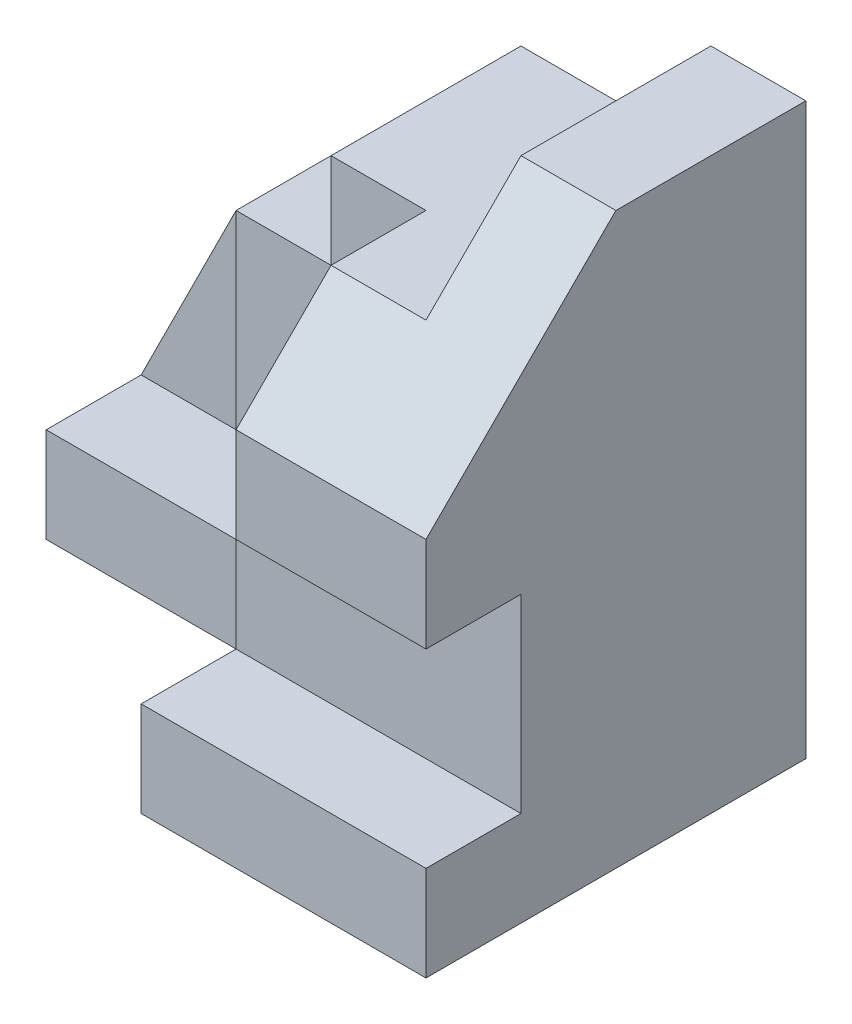
ISO-10303-21;
HEADER;
FILE_DESCRIPTION(('STEP AP214'),'2;1');
FILE_NAME('part.step','',(''),(''),'','','');
FILE_SCHEMA(('AUTOMOTIVE_DESIGN { 1 0 10303 214 1 1 1 1 }'));
ENDSEC;
DATA;
#1=APPLICATION_CONTEXT('core data for automotive mechanical design processes');
#2=APPLICATION_PROTOCOL_DEFINITION('international standard','automotive_design',2000,#1);
#3=PRODUCT_CONTEXT('',#1,'mechanical');
#4=PRODUCT('Part','Part','',(#3));
#5=PRODUCT_RELATED_PRODUCT_CATEGORY('part','',(#4));
#6=PRODUCT_DEFINITION_FORMATION('','',#4);
#7=PRODUCT_DEFINITION_CONTEXT('part definition',#1,'design');
#8=PRODUCT_DEFINITION('design','',#6,#7);
#9=PRODUCT_DEFINITION_SHAPE('','',#8);
#10=(LENGTH_UNIT() NAMED_UNIT(*) SI_UNIT(.MILLI.,.METRE.));
#11=(NAMED_UNIT(*) PLANE_ANGLE_UNIT() SI_UNIT($,.RADIAN.));
#12=(NAMED_UNIT(*) SI_UNIT($,.STERADIAN.) SOLID_ANGLE_UNIT());
#13=UNCERTAINTY_MEASURE_WITH_UNIT(LENGTH_MEASURE(1.E-05),#10,'distance_accuracy_value','');
#14=(GEOMETRIC_REPRESENTATION_CONTEXT(3) GLOBAL_UNCERTAINTY_ASSIGNED_CONTEXT((#13)) GLOBAL_UNIT_ASSIGNED_CONTEXT((#10,
#11,#12)) REPRESENTATION_CONTEXT('',''));
#15=CARTESIAN_POINT('',(0.,0.,0.));
#16=DIRECTION('',(0.,0.,1.));
#17=DIRECTION('',(1.,0.,0.));
#18=AXIS2_PLACEMENT_3D('',#15,#16,#17);
#19=CARTESIAN_POINT('',(60.,60.,40.));
#20=DIRECTION('',(0.,0.,-1.));
#21=DIRECTION('',(-1.,0.,0.));
#22=AXIS2_PLACEMENT_3D('',#19,#20,#21);
#23=PLANE('',#22);
#24=DIRECTION('',(0.,-1.,0.));
#25=VECTOR('',#24,1.);
#26=CARTESIAN_POINT('',(60.,60.,40.));
#27=LINE('',#26,#25);
#28=CARTESIAN_POINT('',(60.,10.,40.));
#29=VERTEX_POINT('',#28);
#30=CARTESIAN_POINT('',(60.,0.,40.));
#31=VERTEX_POINT('',#30);
#32=EDGE_CURVE('E203',#29,#31,#27,.T.);
#33=ORIENTED_EDGE('',*,*,#32,.F.);
#34=DIRECTION('',(-1.,0.,0.));
#35=VECTOR('',#34,1.);
#36=CARTESIAN_POINT('',(60.,10.,40.));
#37=LINE('',#36,#35);
#38=CARTESIAN_POINT('',(30.,10.,40.));
#39=VERTEX_POINT('',#38);
#40=EDGE_CURVE('E413',#29,#39,#37,.T.);
#41=ORIENTED_EDGE('',*,*,#40,.T.);
#42=DIRECTION('',(0.,-1.,0.));
#43=VECTOR('',#42,1.);
#44=CARTESIAN_POINT('',(30.,60.,40.));
#45=LINE('',#44,#43);
#46=CARTESIAN_POINT('',(30.,0.,40.));
#47=VERTEX_POINT('',#46);
#48=EDGE_CURVE('E202',#39,#47,#45,.T.);
#49=ORIENTED_EDGE('',*,*,#48,.T.);
#50=DIRECTION('',(1.,0.,0.));
#51=VECTOR('',#50,1.);
#52=CARTESIAN_POINT('',(60.,0.,40.));
#53=LINE('',#52,#51);
#54=EDGE_CURVE('E337',#47,#31,#53,.T.);
#55=ORIENTED_EDGE('',*,*,#54,.T.);
#56=EDGE_LOOP('',(#33,#41,#49,#55));
#57=FACE_BOUND('',#56,.T.);
#58=ADVANCED_FACE('F33',(#57),#23,.F.);
#59=CARTESIAN_POINT('',(30.,60.,40.));
#60=DIRECTION('',(1.,0.,0.));
#61=DIRECTION('',(0.,0.,-1.));
#62=AXIS2_PLACEMENT_3D('',#59,#60,#61);
#63=PLANE('',#62);
#64=DIRECTION('',(0.,0.,1.));
#65=VECTOR('',#64,1.);
#66=CARTESIAN_POINT('',(30.,40.,0.));
#67=LINE('',#66,#65);
#68=CARTESIAN_POINT('',(30.,40.,0.));
#69=VERTEX_POINT('',#68);
#70=CARTESIAN_POINT('',(30.,40.,20.));
#71=VERTEX_POINT('',#70);
#72=EDGE_CURVE('E303',#69,#71,#67,.T.);
#73=ORIENTED_EDGE('',*,*,#72,.T.);
#74=DIRECTION('',(0.,1.,0.));
#75=VECTOR('',#74,1.);
#76=CARTESIAN_POINT('',(30.,20.,20.));
#77=LINE('',#76,#75);
#78=CARTESIAN_POINT('',(30.,50.,20.));
#79=VERTEX_POINT('',#78);
#80=EDGE_CURVE('E251',#71,#79,#77,.T.);
#81=ORIENTED_EDGE('',*,*,#80,.T.);
#82=DIRECTION('',(0.,0.,1.));
#83=VECTOR('',#82,1.);
#84=CARTESIAN_POINT('',(30.,50.,0.));
#85=LINE('',#84,#83);
#86=CARTESIAN_POINT('',(30.,50.,0.));
#87=VERTEX_POINT('',#86);
#88=EDGE_CURVE('E300',#87,#79,#85,.T.);
#89=ORIENTED_EDGE('',*,*,#88,.F.);
#90=DIRECTION('',(0.,1.,0.));
#91=VECTOR('',#90,1.);
#92=CARTESIAN_POINT('',(30.,50.,0.));
#93=LINE('',#92,#91);
#94=EDGE_CURVE('E283',#69,#87,#93,.T.);
#95=ORIENTED_EDGE('',*,*,#94,.F.);
#96=EDGE_LOOP('',(#73,#81,#89,#95));
#97=FACE_BOUND('',#96,.T.);
#98=ADVANCED_FACE('F387',(#97),#63,.F.);
#99=CARTESIAN_POINT('',(0.,60.,20.));
#100=DIRECTION('',(1.,0.,0.));
#101=DIRECTION('',(0.,0.,-1.));
#102=AXIS2_PLACEMENT_3D('',#99,#100,#101);
#103=PLANE('',#102);
#104=DIRECTION('',(0.,-1.,0.));
#105=VECTOR('',#104,1.);
#106=CARTESIAN_POINT('',(0.,60.,20.));
#107=LINE('',#106,#105);
#108=CARTESIAN_POINT('',(0.,10.,20.));
#109=VERTEX_POINT('',#108);
#110=CARTESIAN_POINT('',(0.,0.,20.));
#111=VERTEX_POINT('',#110);
#112=EDGE_CURVE('E212',#109,#111,#107,.T.);
#113=ORIENTED_EDGE('',*,*,#112,.F.);
#114=DIRECTION('',(0.,0.,1.));
#115=VECTOR('',#114,1.);
#116=CARTESIAN_POINT('',(0.,10.,10.));
#117=LINE('',#116,#115);
#118=CARTESIAN_POINT('',(0.,10.,10.));
#119=VERTEX_POINT('',#118);
#120=EDGE_CURVE('E264',#119,#109,#117,.T.);
#121=ORIENTED_EDGE('',*,*,#120,.F.);
#122=DIRECTION('',(0.,0.,1.));
#123=VECTOR('',#122,1.);
#124=CARTESIAN_POINT('',(0.,10.,0.));
#125=LINE('',#124,#123);
#126=CARTESIAN_POINT('',(0.,10.,0.));
#127=VERTEX_POINT('',#126);
#128=EDGE_CURVE('E292',#127,#119,#125,.T.);
#129=ORIENTED_EDGE('',*,*,#128,.F.);
#130=DIRECTION('',(0.,-1.,0.));
#131=VECTOR('',#130,1.);
#132=CARTESIAN_POINT('',(0.,60.,0.));
#133=LINE('',#132,#131);
#134=CARTESIAN_POINT('',(0.,0.,0.));
#135=VERTEX_POINT('',#134);
#136=EDGE_CURVE('E328',#127,#135,#133,.T.);
#137=ORIENTED_EDGE('',*,*,#136,.T.);
#138=DIRECTION('',(0.,0.,1.));
#139=VECTOR('',#138,1.);
#140=CARTESIAN_POINT('',(0.,0.,20.));
#141=LINE('',#140,#139);
#142=EDGE_CURVE('E321',#135,#111,#141,.T.);
#143=ORIENTED_EDGE('',*,*,#142,.T.);
#144=EDGE_LOOP('',(#113,#121,#129,#137,#143));
#145=FACE_BOUND('',#144,.T.);
#146=ADVANCED_FACE('F360',(#145),#103,.F.);
#147=CARTESIAN_POINT('',(30.,60.,20.));
#148=DIRECTION('',(0.,0.,-1.));
#149=DIRECTION('',(-1.,0.,0.));
#150=AXIS2_PLACEMENT_3D('',#147,#148,#149);
#151=PLANE('',#150);
#152=DIRECTION('',(0.,-1.,0.));
#153=VECTOR('',#152,1.);
#154=CARTESIAN_POINT('',(20.,60.,20.));
#155=LINE('',#154,#153);
#156=CARTESIAN_POINT('',(20.,40.,20.));
#157=VERTEX_POINT('',#156);
#158=CARTESIAN_POINT('',(20.,10.,20.));
#159=VERTEX_POINT('',#158);
#160=EDGE_CURVE('E296',#157,#159,#155,.T.);
#161=ORIENTED_EDGE('',*,*,#160,.T.);
#162=DIRECTION('',(1.,0.,0.));
#163=VECTOR('',#162,1.);
#164=CARTESIAN_POINT('',(20.,10.,20.));
#165=LINE('',#164,#163);
#166=EDGE_CURVE('E254',#109,#159,#165,.T.);
#167=ORIENTED_EDGE('',*,*,#166,.F.);
#168=ORIENTED_EDGE('',*,*,#112,.T.);
#169=DIRECTION('',(1.,0.,0.));
#170=VECTOR('',#169,1.);
#171=CARTESIAN_POINT('',(30.,0.,20.));
#172=LINE('',#171,#170);
#173=CARTESIAN_POINT('',(30.,0.,20.));
#174=VERTEX_POINT('',#173);
#175=EDGE_CURVE('E331',#111,#174,#172,.T.);
#176=ORIENTED_EDGE('',*,*,#175,.T.);
#177=DIRECTION('',(0.,-1.,0.));
#178=VECTOR('',#177,1.);
#179=CARTESIAN_POINT('',(30.,60.,20.));
#180=LINE('',#179,#178);
#181=CARTESIAN_POINT('',(30.,20.,20.));
#182=VERTEX_POINT('',#181);
#183=EDGE_CURVE('E205',#182,#174,#180,.T.);
#184=ORIENTED_EDGE('',*,*,#183,.F.);
#185=DIRECTION('',(-1.,0.,0.));
#186=VECTOR('',#185,1.);
#187=CARTESIAN_POINT('',(30.,20.,20.));
#188=LINE('',#187,#186);
#189=CARTESIAN_POINT('',(40.,20.,20.));
#190=VERTEX_POINT('',#189);
#191=EDGE_CURVE('E241',#190,#182,#188,.T.);
#192=ORIENTED_EDGE('',*,*,#191,.F.);
#193=DIRECTION('',(0.,1.,0.));
#194=VECTOR('',#193,1.);
#195=CARTESIAN_POINT('',(40.,20.,20.));
#196=LINE('',#195,#194);
#197=CARTESIAN_POINT('',(40.,50.,20.));
#198=VERTEX_POINT('',#197);
#199=EDGE_CURVE('E239',#190,#198,#196,.T.);
#200=ORIENTED_EDGE('',*,*,#199,.T.);
#201=DIRECTION('',(-1.,0.,0.));
#202=VECTOR('',#201,1.);
#203=CARTESIAN_POINT('',(30.,50.,20.));
#204=LINE('',#203,#202);
#205=EDGE_CURVE('E244',#198,#79,#204,.T.);
#206=ORIENTED_EDGE('',*,*,#205,.T.);
#207=ORIENTED_EDGE('',*,*,#80,.F.);
#208=DIRECTION('',(-1.,0.,0.));
#209=VECTOR('',#208,1.);
#210=CARTESIAN_POINT('',(30.,40.,20.));
#211=LINE('',#210,#209);
#212=EDGE_CURVE('E318',#71,#157,#211,.T.);
#213=ORIENTED_EDGE('',*,*,#212,.T.);
#214=EDGE_LOOP('',(#161,#167,#168,#176,#184,#192,#200,#206,#207,#213));
#215=FACE_BOUND('',#214,.T.);
#216=ADVANCED_FACE('F364',(#215),#151,.F.);
#217=ORIENTED_EDGE('',*,*,#48,.F.);
#218=DIRECTION('',(0.,0.,1.));
#219=VECTOR('',#218,1.);
#220=CARTESIAN_POINT('',(30.,10.,40.));
#221=LINE('',#220,#219);
#222=CARTESIAN_POINT('',(30.,10.,30.));
#223=VERTEX_POINT('',#222);
#224=EDGE_CURVE('E189',#223,#39,#221,.T.);
#225=ORIENTED_EDGE('',*,*,#224,.F.);
#226=DIRECTION('',(0.,-1.,0.));
#227=VECTOR('',#226,1.);
#228=CARTESIAN_POINT('',(30.,10.,30.));
#229=LINE('',#228,#227);
#230=CARTESIAN_POINT('',(30.,20.,30.));
#231=VERTEX_POINT('',#230);
#232=EDGE_CURVE('E406',#231,#223,#229,.T.);
#233=ORIENTED_EDGE('',*,*,#232,.F.);
#234=DIRECTION('',(0.,0.,1.));
#235=VECTOR('',#234,1.);
#236=CARTESIAN_POINT('',(30.,20.,40.));
#237=LINE('',#236,#235);
#238=EDGE_CURVE('E235',#182,#231,#237,.T.);
#239=ORIENTED_EDGE('',*,*,#238,.F.);
#240=ORIENTED_EDGE('',*,*,#183,.T.);
#241=DIRECTION('',(0.,0.,1.));
#242=VECTOR('',#241,1.);
#243=CARTESIAN_POINT('',(30.,0.,40.));
#244=LINE('',#243,#242);
#245=EDGE_CURVE('E334',#174,#47,#244,.T.);
#246=ORIENTED_EDGE('',*,*,#245,.T.);
#247=EDGE_LOOP('',(#217,#225,#233,#239,#240,#246));
#248=FACE_BOUND('',#247,.T.);
#249=ADVANCED_FACE('F404',(#248),#63,.F.);
#250=DIRECTION('',(0.,1.,0.));
#251=VECTOR('',#250,1.);
#252=CARTESIAN_POINT('',(40.,20.,40.));
#253=LINE('',#252,#251);
#254=CARTESIAN_POINT('',(40.,30.,40.));
#255=VERTEX_POINT('',#254);
#256=CARTESIAN_POINT('',(40.,40.,40.));
#257=VERTEX_POINT('',#256);
#258=EDGE_CURVE('E55',#255,#257,#253,.T.);
#259=ORIENTED_EDGE('',*,*,#258,.F.);
#260=DIRECTION('',(-1.,0.,0.));
#261=VECTOR('',#260,1.);
#262=CARTESIAN_POINT('',(60.,30.,40.));
#263=LINE('',#262,#261);
#264=CARTESIAN_POINT('',(60.,30.,40.));
#265=VERTEX_POINT('',#264);
#266=EDGE_CURVE('E182',#265,#255,#263,.T.);
#267=ORIENTED_EDGE('',*,*,#266,.F.);
#268=CARTESIAN_POINT('',(60.,40.,40.));
#269=VERTEX_POINT('',#268);
#270=EDGE_CURVE('E195',#269,#265,#27,.T.);
#271=ORIENTED_EDGE('',*,*,#270,.F.);
#272=DIRECTION('',(-1.,0.,0.));
#273=VECTOR('',#272,1.);
#274=CARTESIAN_POINT('',(60.,40.,40.));
#275=LINE('',#274,#273);
#276=EDGE_CURVE('E221',#269,#257,#275,.T.);
#277=ORIENTED_EDGE('',*,*,#276,.T.);
#278=EDGE_LOOP('',(#259,#267,#271,#277));
#279=FACE_BOUND('',#278,.T.);
#280=ADVANCED_FACE('F193',(#279),#23,.F.);
#281=CARTESIAN_POINT('',(60.,60.,0.));
#282=DIRECTION('',(-1.,0.,0.));
#283=DIRECTION('',(0.,0.,1.));
#284=AXIS2_PLACEMENT_3D('',#281,#282,#283);
#285=PLANE('',#284);
#286=DIRECTION('',(0.,-1.,0.));
#287=VECTOR('',#286,1.);
#288=CARTESIAN_POINT('',(60.,10.,30.));
#289=LINE('',#288,#287);
#290=CARTESIAN_POINT('',(60.,30.,30.));
#291=VERTEX_POINT('',#290);
#292=CARTESIAN_POINT('',(60.,10.,30.));
#293=VERTEX_POINT('',#292);
#294=EDGE_CURVE('E188',#291,#293,#289,.T.);
#295=ORIENTED_EDGE('',*,*,#294,.T.);
#296=DIRECTION('',(0.,0.,1.));
#297=VECTOR('',#296,1.);
#298=CARTESIAN_POINT('',(60.,10.,40.));
#299=LINE('',#298,#297);
#300=EDGE_CURVE('E197',#293,#29,#299,.T.);
#301=ORIENTED_EDGE('',*,*,#300,.T.);
#302=ORIENTED_EDGE('',*,*,#32,.T.);
#303=DIRECTION('',(0.,0.,-1.));
#304=VECTOR('',#303,1.);
#305=CARTESIAN_POINT('',(60.,0.,0.));
#306=LINE('',#305,#304);
#307=CARTESIAN_POINT('',(60.,0.,0.));
#308=VERTEX_POINT('',#307);
#309=EDGE_CURVE('E340',#31,#308,#306,.T.);
#310=ORIENTED_EDGE('',*,*,#309,.T.);
#311=DIRECTION('',(0.,-1.,0.));
#312=VECTOR('',#311,1.);
#313=CARTESIAN_POINT('',(60.,60.,0.));
#314=LINE('',#313,#312);
#315=CARTESIAN_POINT('',(60.,60.,0.));
#316=VERTEX_POINT('',#315);
#317=EDGE_CURVE('E207',#316,#308,#314,.T.);
#318=ORIENTED_EDGE('',*,*,#317,.F.);
#319=DIRECTION('',(0.,0.,-1.));
#320=VECTOR('',#319,1.);
#321=CARTESIAN_POINT('',(60.,60.,0.));
#322=LINE('',#321,#320);
#323=CARTESIAN_POINT('',(60.,60.,20.));
#324=VERTEX_POINT('',#323);
#325=EDGE_CURVE('E322',#324,#316,#322,.T.);
#326=ORIENTED_EDGE('',*,*,#325,.F.);
#327=DIRECTION('',(0.,0.707106781186548,-0.707106781186547));
#328=VECTOR('',#327,1.);
#329=CARTESIAN_POINT('',(60.,60.,20.));
#330=LINE('',#329,#328);
#331=EDGE_CURVE('E201',#324,#269,#330,.F.);
#332=ORIENTED_EDGE('',*,*,#331,.T.);
#333=ORIENTED_EDGE('',*,*,#270,.T.);
#334=DIRECTION('',(0.,0.,-1.));
#335=VECTOR('',#334,1.);
#336=CARTESIAN_POINT('',(60.,30.,40.));
#337=LINE('',#336,#335);
#338=EDGE_CURVE('E179',#265,#291,#337,.T.);
#339=ORIENTED_EDGE('',*,*,#338,.T.);
#340=EDGE_LOOP('',(#295,#301,#302,#310,#318,#326,#332,#333,#339));
#341=FACE_BOUND('',#340,.T.);
#342=ADVANCED_FACE('F199',(#341),#285,.F.);
#343=CARTESIAN_POINT('',(0.,60.,0.));
#344=DIRECTION('',(0.,0.,1.));
#345=DIRECTION('',(1.,0.,0.));
#346=AXIS2_PLACEMENT_3D('',#343,#344,#345);
#347=PLANE('',#346);
#348=DIRECTION('',(1.,0.,0.));
#349=VECTOR('',#348,1.);
#350=CARTESIAN_POINT('',(50.,50.,0.));
#351=LINE('',#350,#349);
#352=CARTESIAN_POINT('',(50.,50.,0.));
#353=VERTEX_POINT('',#352);
#354=EDGE_CURVE('E286',#87,#353,#351,.T.);
#355=ORIENTED_EDGE('',*,*,#354,.T.);
#356=DIRECTION('',(0.,1.,0.));
#357=VECTOR('',#356,1.);
#358=CARTESIAN_POINT('',(50.,60.,0.));
#359=LINE('',#358,#357);
#360=CARTESIAN_POINT('',(50.,60.,0.));
#361=VERTEX_POINT('',#360);
#362=EDGE_CURVE('E289',#353,#361,#359,.T.);
#363=ORIENTED_EDGE('',*,*,#362,.T.);
#364=DIRECTION('',(-1.,0.,0.));
#365=VECTOR('',#364,1.);
#366=CARTESIAN_POINT('',(0.,60.,0.));
#367=LINE('',#366,#365);
#368=EDGE_CURVE('E324',#316,#361,#367,.T.);
#369=ORIENTED_EDGE('',*,*,#368,.F.);
#370=ORIENTED_EDGE('',*,*,#317,.T.);
#371=DIRECTION('',(-1.,0.,0.));
#372=VECTOR('',#371,1.);
#373=CARTESIAN_POINT('',(0.,0.,0.));
#374=LINE('',#373,#372);
#375=EDGE_CURVE('E325',#308,#135,#374,.T.);
#376=ORIENTED_EDGE('',*,*,#375,.T.);
#377=ORIENTED_EDGE('',*,*,#136,.F.);
#378=DIRECTION('',(0.447213595499958,0.894427190999916,0.));
#379=VECTOR('',#378,1.);
#380=CARTESIAN_POINT('',(0.,10.,0.));
#381=LINE('',#380,#379);
#382=CARTESIAN_POINT('',(10.,30.,0.));
#383=VERTEX_POINT('',#382);
#384=EDGE_CURVE('E270',#127,#383,#381,.T.);
#385=ORIENTED_EDGE('',*,*,#384,.T.);
#386=DIRECTION('',(1.,0.,0.));
#387=VECTOR('',#386,1.);
#388=CARTESIAN_POINT('',(10.,30.,0.));
#389=LINE('',#388,#387);
#390=CARTESIAN_POINT('',(20.,30.,0.));
#391=VERTEX_POINT('',#390);
#392=EDGE_CURVE('E274',#383,#391,#389,.T.);
#393=ORIENTED_EDGE('',*,*,#392,.T.);
#394=DIRECTION('',(0.,1.,0.));
#395=VECTOR('',#394,1.);
#396=CARTESIAN_POINT('',(20.,40.,0.));
#397=LINE('',#396,#395);
#398=CARTESIAN_POINT('',(20.,40.,0.));
#399=VERTEX_POINT('',#398);
#400=EDGE_CURVE('E277',#391,#399,#397,.T.);
#401=ORIENTED_EDGE('',*,*,#400,.T.);
#402=DIRECTION('',(1.,0.,0.));
#403=VECTOR('',#402,1.);
#404=CARTESIAN_POINT('',(30.,40.,0.));
#405=LINE('',#404,#403);
#406=EDGE_CURVE('E280',#399,#69,#405,.T.);
#407=ORIENTED_EDGE('',*,*,#406,.T.);
#408=ORIENTED_EDGE('',*,*,#94,.T.);
#409=EDGE_LOOP('',(#355,#363,#369,#370,#376,#377,#385,#393,#401,#407,#408));
#410=FACE_BOUND('',#409,.T.);
#411=ADVANCED_FACE('F351',(#410),#347,.F.);
#412=CARTESIAN_POINT('',(0.,60.,0.));
#413=DIRECTION('',(0.,-1.,0.));
#414=DIRECTION('',(0.,0.,-1.));
#415=AXIS2_PLACEMENT_3D('',#412,#413,#414);
#416=PLANE('',#415);
#417=DIRECTION('',(0.,0.,1.));
#418=VECTOR('',#417,1.);
#419=CARTESIAN_POINT('',(50.,60.,0.));
#420=LINE('',#419,#418);
#421=CARTESIAN_POINT('',(50.,60.,20.));
#422=VERTEX_POINT('',#421);
#423=EDGE_CURVE('E293',#361,#422,#420,.T.);
#424=ORIENTED_EDGE('',*,*,#423,.T.);
#425=DIRECTION('',(1.,0.,0.));
#426=VECTOR('',#425,1.);
#427=CARTESIAN_POINT('',(0.,60.,20.));
#428=LINE('',#427,#426);
#429=EDGE_CURVE('E217',#422,#324,#428,.T.);
#430=ORIENTED_EDGE('',*,*,#429,.T.);
#431=ORIENTED_EDGE('',*,*,#325,.T.);
#432=ORIENTED_EDGE('',*,*,#368,.T.);
#433=EDGE_LOOP('',(#424,#430,#431,#432));
#434=FACE_BOUND('',#433,.T.);
#435=ADVANCED_FACE('F400',(#434),#416,.F.);
#436=CARTESIAN_POINT('',(0.,0.,0.));
#437=DIRECTION('',(0.,-1.,0.));
#438=DIRECTION('',(0.,0.,-1.));
#439=AXIS2_PLACEMENT_3D('',#436,#437,#438);
#440=PLANE('',#439);
#441=ORIENTED_EDGE('',*,*,#142,.F.);
#442=ORIENTED_EDGE('',*,*,#375,.F.);
#443=ORIENTED_EDGE('',*,*,#309,.F.);
#444=ORIENTED_EDGE('',*,*,#54,.F.);
#445=ORIENTED_EDGE('',*,*,#245,.F.);
#446=ORIENTED_EDGE('',*,*,#175,.F.);
#447=EDGE_LOOP('',(#441,#442,#443,#444,#445,#446));
#448=FACE_BOUND('',#447,.T.);
#449=ADVANCED_FACE('F355',(#448),#440,.T.);
#450=CARTESIAN_POINT('',(30.,40.,0.));
#451=DIRECTION('',(0.,-1.,0.));
#452=DIRECTION('',(1.,0.,0.));
#453=AXIS2_PLACEMENT_3D('',#450,#451,#452);
#454=PLANE('',#453);
#455=ORIENTED_EDGE('',*,*,#72,.F.);
#456=ORIENTED_EDGE('',*,*,#406,.F.);
#457=DIRECTION('',(0.,0.,1.));
#458=VECTOR('',#457,1.);
#459=CARTESIAN_POINT('',(20.,40.,0.));
#460=LINE('',#459,#458);
#461=EDGE_CURVE('E306',#399,#157,#460,.T.);
#462=ORIENTED_EDGE('',*,*,#461,.T.);
#463=ORIENTED_EDGE('',*,*,#212,.F.);
#464=EDGE_LOOP('',(#455,#456,#462,#463));
#465=FACE_BOUND('',#464,.T.);
#466=ADVANCED_FACE('F384',(#465),#454,.F.);
#467=CARTESIAN_POINT('',(20.,40.,0.));
#468=DIRECTION('',(1.,0.,0.));
#469=DIRECTION('',(0.,1.,0.));
#470=AXIS2_PLACEMENT_3D('',#467,#468,#469);
#471=PLANE('',#470);
#472=ORIENTED_EDGE('',*,*,#461,.F.);
#473=ORIENTED_EDGE('',*,*,#400,.F.);
#474=DIRECTION('',(0.,0.,1.));
#475=VECTOR('',#474,1.);
#476=CARTESIAN_POINT('',(20.,30.,0.));
#477=LINE('',#476,#475);
#478=CARTESIAN_POINT('',(20.,30.,10.));
#479=VERTEX_POINT('',#478);
#480=EDGE_CURVE('E309',#391,#479,#477,.T.);
#481=ORIENTED_EDGE('',*,*,#480,.T.);
#482=DIRECTION('',(0.,1.,0.));
#483=VECTOR('',#482,1.);
#484=CARTESIAN_POINT('',(20.,30.,10.));
#485=LINE('',#484,#483);
#486=CARTESIAN_POINT('',(20.,10.,10.));
#487=VERTEX_POINT('',#486);
#488=EDGE_CURVE('E257',#487,#479,#485,.T.);
#489=ORIENTED_EDGE('',*,*,#488,.F.);
#490=DIRECTION('',(0.,0.,1.));
#491=VECTOR('',#490,1.);
#492=CARTESIAN_POINT('',(20.,10.,10.));
#493=LINE('',#492,#491);
#494=EDGE_CURVE('E267',#487,#159,#493,.T.);
#495=ORIENTED_EDGE('',*,*,#494,.T.);
#496=ORIENTED_EDGE('',*,*,#160,.F.);
#497=EDGE_LOOP('',(#472,#473,#481,#489,#495,#496));
#498=FACE_BOUND('',#497,.T.);
#499=ADVANCED_FACE('F381',(#498),#471,.F.);
#500=CARTESIAN_POINT('',(10.,30.,0.));
#501=DIRECTION('',(0.,-1.,0.));
#502=DIRECTION('',(0.,0.,-1.));
#503=AXIS2_PLACEMENT_3D('',#500,#501,#502);
#504=PLANE('',#503);
#505=DIRECTION('',(0.,0.,1.));
#506=VECTOR('',#505,1.);
#507=CARTESIAN_POINT('',(10.,30.,0.));
#508=LINE('',#507,#506);
#509=CARTESIAN_POINT('',(10.,30.,10.));
#510=VERTEX_POINT('',#509);
#511=EDGE_CURVE('E312',#383,#510,#508,.T.);
#512=ORIENTED_EDGE('',*,*,#511,.T.);
#513=DIRECTION('',(-1.,0.,0.));
#514=VECTOR('',#513,1.);
#515=CARTESIAN_POINT('',(20.,30.,10.));
#516=LINE('',#515,#514);
#517=EDGE_CURVE('E259',#479,#510,#516,.T.);
#518=ORIENTED_EDGE('',*,*,#517,.F.);
#519=ORIENTED_EDGE('',*,*,#480,.F.);
#520=ORIENTED_EDGE('',*,*,#392,.F.);
#521=EDGE_LOOP('',(#512,#518,#519,#520));
#522=FACE_BOUND('',#521,.T.);
#523=ADVANCED_FACE('F377',(#522),#504,.F.);
#524=CARTESIAN_POINT('',(0.,10.,0.));
#525=DIRECTION('',(0.894427190999916,-0.447213595499958,0.));
#526=DIRECTION('',(0.447213595499958,0.894427190999916,0.));
#527=AXIS2_PLACEMENT_3D('',#524,#525,#526);
#528=PLANE('',#527);
#529=ORIENTED_EDGE('',*,*,#128,.T.);
#530=DIRECTION('',(0.447213595499958,0.894427190999916,0.));
#531=VECTOR('',#530,1.);
#532=CARTESIAN_POINT('',(0.,10.,10.));
#533=LINE('',#532,#531);
#534=EDGE_CURVE('E214',#119,#510,#533,.T.);
#535=ORIENTED_EDGE('',*,*,#534,.T.);
#536=ORIENTED_EDGE('',*,*,#511,.F.);
#537=ORIENTED_EDGE('',*,*,#384,.F.);
#538=EDGE_LOOP('',(#529,#535,#536,#537));
#539=FACE_BOUND('',#538,.T.);
#540=ADVANCED_FACE('F374',(#539),#528,.F.);
#541=CARTESIAN_POINT('',(50.,60.,0.));
#542=DIRECTION('',(1.,0.,0.));
#543=DIRECTION('',(0.,0.,-1.));
#544=AXIS2_PLACEMENT_3D('',#541,#542,#543);
#545=PLANE('',#544);
#546=DIRECTION('',(0.,0.,1.));
#547=VECTOR('',#546,1.);
#548=CARTESIAN_POINT('',(50.,50.,0.));
#549=LINE('',#548,#547);
#550=CARTESIAN_POINT('',(50.,50.,30.));
#551=VERTEX_POINT('',#550);
#552=EDGE_CURVE('E297',#353,#551,#549,.T.);
#553=ORIENTED_EDGE('',*,*,#552,.T.);
#554=DIRECTION('',(0.,-0.707106781186548,0.707106781186547));
#555=VECTOR('',#554,1.);
#556=CARTESIAN_POINT('',(50.,60.,20.));
#557=LINE('',#556,#555);
#558=EDGE_CURVE('E225',#551,#422,#557,.F.);
#559=ORIENTED_EDGE('',*,*,#558,.T.);
#560=ORIENTED_EDGE('',*,*,#423,.F.);
#561=ORIENTED_EDGE('',*,*,#362,.F.);
#562=EDGE_LOOP('',(#553,#559,#560,#561));
#563=FACE_BOUND('',#562,.T.);
#564=ADVANCED_FACE('F397',(#563),#545,.F.);
#565=CARTESIAN_POINT('',(50.,50.,0.));
#566=DIRECTION('',(0.,-1.,0.));
#567=DIRECTION('',(1.,0.,0.));
#568=AXIS2_PLACEMENT_3D('',#565,#566,#567);
#569=PLANE('',#568);
#570=ORIENTED_EDGE('',*,*,#88,.T.);
#571=ORIENTED_EDGE('',*,*,#205,.F.);
#572=DIRECTION('',(0.,0.,-1.));
#573=VECTOR('',#572,1.);
#574=CARTESIAN_POINT('',(40.,50.,40.));
#575=LINE('',#574,#573);
#576=CARTESIAN_POINT('',(40.,50.,30.));
#577=VERTEX_POINT('',#576);
#578=EDGE_CURVE('E248',#577,#198,#575,.T.);
#579=ORIENTED_EDGE('',*,*,#578,.F.);
#580=DIRECTION('',(-1.,0.,0.));
#581=VECTOR('',#580,1.);
#582=CARTESIAN_POINT('',(0.,50.,29.9999999999999));
#583=LINE('',#582,#581);
#584=EDGE_CURVE('E223',#577,#551,#583,.F.);
#585=ORIENTED_EDGE('',*,*,#584,.T.);
#586=ORIENTED_EDGE('',*,*,#552,.F.);
#587=ORIENTED_EDGE('',*,*,#354,.F.);
#588=EDGE_LOOP('',(#570,#571,#579,#585,#586,#587));
#589=FACE_BOUND('',#588,.T.);
#590=ADVANCED_FACE('F391',(#589),#569,.F.);
#591=CARTESIAN_POINT('',(0.,0.,10.));
#592=DIRECTION('',(0.,0.,-1.));
#593=DIRECTION('',(-1.,0.,0.));
#594=AXIS2_PLACEMENT_3D('',#591,#592,#593);
#595=PLANE('',#594);
#596=DIRECTION('',(1.,0.,0.));
#597=VECTOR('',#596,1.);
#598=CARTESIAN_POINT('',(20.,10.,10.));
#599=LINE('',#598,#597);
#600=EDGE_CURVE('E261',#119,#487,#599,.T.);
#601=ORIENTED_EDGE('',*,*,#600,.T.);
#602=ORIENTED_EDGE('',*,*,#488,.T.);
#603=ORIENTED_EDGE('',*,*,#517,.T.);
#604=ORIENTED_EDGE('',*,*,#534,.F.);
#605=EDGE_LOOP('',(#601,#602,#603,#604));
#606=FACE_BOUND('',#605,.T.);
#607=ADVANCED_FACE('F371',(#606),#595,.F.);
#608=CARTESIAN_POINT('',(20.,10.,10.));
#609=DIRECTION('',(0.,-1.,0.));
#610=DIRECTION('',(0.,0.,-1.));
#611=AXIS2_PLACEMENT_3D('',#608,#609,#610);
#612=PLANE('',#611);
#613=ORIENTED_EDGE('',*,*,#166,.T.);
#614=ORIENTED_EDGE('',*,*,#494,.F.);
#615=ORIENTED_EDGE('',*,*,#600,.F.);
#616=ORIENTED_EDGE('',*,*,#120,.T.);
#617=EDGE_LOOP('',(#613,#614,#615,#616));
#618=FACE_BOUND('',#617,.T.);
#619=ADVANCED_FACE('F367',(#618),#612,.F.);
#620=CARTESIAN_POINT('',(0.,60.,20.));
#621=DIRECTION('',(0.,-0.707106781186547,-0.707106781186548));
#622=DIRECTION('',(1.,0.,0.));
#623=AXIS2_PLACEMENT_3D('',#620,#621,#622);
#624=PLANE('',#623);
#625=DIRECTION('',(0.,-0.707106781186548,0.707106781186547));
#626=VECTOR('',#625,1.);
#627=CARTESIAN_POINT('',(40.,60.,20.));
#628=LINE('',#627,#626);
#629=EDGE_CURVE('E227',#257,#577,#628,.F.);
#630=ORIENTED_EDGE('',*,*,#629,.F.);
#631=ORIENTED_EDGE('',*,*,#276,.F.);
#632=ORIENTED_EDGE('',*,*,#331,.F.);
#633=ORIENTED_EDGE('',*,*,#429,.F.);
#634=ORIENTED_EDGE('',*,*,#558,.F.);
#635=ORIENTED_EDGE('',*,*,#584,.F.);
#636=EDGE_LOOP('',(#630,#631,#632,#633,#634,#635));
#637=FACE_BOUND('',#636,.T.);
#638=ADVANCED_FACE('F35',(#637),#624,.F.);
#639=CARTESIAN_POINT('',(40.,20.,40.));
#640=DIRECTION('',(1.,0.,0.));
#641=DIRECTION('',(0.,1.,0.));
#642=AXIS2_PLACEMENT_3D('',#639,#640,#641);
#643=PLANE('',#642);
#644=DIRECTION('',(0.,0.,-1.));
#645=VECTOR('',#644,1.);
#646=CARTESIAN_POINT('',(40.,20.,40.));
#647=LINE('',#646,#645);
#648=CARTESIAN_POINT('',(40.,20.,30.));
#649=VERTEX_POINT('',#648);
#650=EDGE_CURVE('E232',#649,#190,#647,.T.);
#651=ORIENTED_EDGE('',*,*,#650,.F.);
#652=DIRECTION('',(0.,1.,0.));
#653=VECTOR('',#652,1.);
#654=CARTESIAN_POINT('',(40.,20.,30.));
#655=LINE('',#654,#653);
#656=CARTESIAN_POINT('',(40.,30.,30.));
#657=VERTEX_POINT('',#656);
#658=EDGE_CURVE('E48',#649,#657,#655,.T.);
#659=ORIENTED_EDGE('',*,*,#658,.T.);
#660=DIRECTION('',(0.,0.,1.));
#661=VECTOR('',#660,1.);
#662=CARTESIAN_POINT('',(40.,30.,40.));
#663=LINE('',#662,#661);
#664=EDGE_CURVE('E11',#657,#255,#663,.T.);
#665=ORIENTED_EDGE('',*,*,#664,.T.);
#666=ORIENTED_EDGE('',*,*,#258,.T.);
#667=ORIENTED_EDGE('',*,*,#629,.T.);
#668=ORIENTED_EDGE('',*,*,#578,.T.);
#669=ORIENTED_EDGE('',*,*,#199,.F.);
#670=EDGE_LOOP('',(#651,#659,#665,#666,#667,#668,#669));
#671=FACE_BOUND('',#670,.T.);
#672=ADVANCED_FACE('F237',(#671),#643,.F.);
#673=CARTESIAN_POINT('',(0.,20.,0.));
#674=DIRECTION('',(0.,-1.,0.));
#675=DIRECTION('',(0.,0.,-1.));
#676=AXIS2_PLACEMENT_3D('',#673,#674,#675);
#677=PLANE('',#676);
#678=ORIENTED_EDGE('',*,*,#238,.T.);
#679=DIRECTION('',(1.,0.,0.));
#680=VECTOR('',#679,1.);
#681=CARTESIAN_POINT('',(0.,20.,30.));
#682=LINE('',#681,#680);
#683=EDGE_CURVE('E41',#231,#649,#682,.T.);
#684=ORIENTED_EDGE('',*,*,#683,.T.);
#685=ORIENTED_EDGE('',*,*,#650,.T.);
#686=ORIENTED_EDGE('',*,*,#191,.T.);
#687=EDGE_LOOP('',(#678,#684,#685,#686));
#688=FACE_BOUND('',#687,.T.);
#689=ADVANCED_FACE('F231',(#688),#677,.F.);
#690=CARTESIAN_POINT('',(60.,30.,40.));
#691=DIRECTION('',(0.,1.,0.));
#692=DIRECTION('',(0.,0.,1.));
#693=AXIS2_PLACEMENT_3D('',#690,#691,#692);
#694=PLANE('',#693);
#695=DIRECTION('',(-1.,0.,0.));
#696=VECTOR('',#695,1.);
#697=CARTESIAN_POINT('',(60.,30.,30.));
#698=LINE('',#697,#696);
#699=EDGE_CURVE('E183',#291,#657,#698,.T.);
#700=ORIENTED_EDGE('',*,*,#699,.F.);
#701=ORIENTED_EDGE('',*,*,#338,.F.);
#702=ORIENTED_EDGE('',*,*,#266,.T.);
#703=ORIENTED_EDGE('',*,*,#664,.F.);
#704=EDGE_LOOP('',(#700,#701,#702,#703));
#705=FACE_BOUND('',#704,.T.);
#706=ADVANCED_FACE('F181',(#705),#694,.F.);
#707=CARTESIAN_POINT('',(60.,10.,30.));
#708=DIRECTION('',(0.,0.,-1.));
#709=DIRECTION('',(0.,1.,0.));
#710=AXIS2_PLACEMENT_3D('',#707,#708,#709);
#711=PLANE('',#710);
#712=ORIENTED_EDGE('',*,*,#683,.F.);
#713=ORIENTED_EDGE('',*,*,#232,.T.);
#714=DIRECTION('',(-1.,0.,0.));
#715=VECTOR('',#714,1.);
#716=CARTESIAN_POINT('',(60.,10.,30.));
#717=LINE('',#716,#715);
#718=EDGE_CURVE('E416',#293,#223,#717,.T.);
#719=ORIENTED_EDGE('',*,*,#718,.F.);
#720=ORIENTED_EDGE('',*,*,#294,.F.);
#721=ORIENTED_EDGE('',*,*,#699,.T.);
#722=ORIENTED_EDGE('',*,*,#658,.F.);
#723=EDGE_LOOP('',(#712,#713,#719,#720,#721,#722));
#724=FACE_BOUND('',#723,.T.);
#725=ADVANCED_FACE('F418',(#724),#711,.F.);
#726=CARTESIAN_POINT('',(60.,10.,40.));
#727=DIRECTION('',(0.,-1.,0.));
#728=DIRECTION('',(0.,0.,-1.));
#729=AXIS2_PLACEMENT_3D('',#726,#727,#728);
#730=PLANE('',#729);
#731=ORIENTED_EDGE('',*,*,#224,.T.);
#732=ORIENTED_EDGE('',*,*,#40,.F.);
#733=ORIENTED_EDGE('',*,*,#300,.F.);
#734=ORIENTED_EDGE('',*,*,#718,.T.);
#735=EDGE_LOOP('',(#731,#732,#733,#734));
#736=FACE_BOUND('',#735,.T.);
#737=ADVANCED_FACE('F424',(#736),#730,.F.);
#738=CLOSED_SHELL('',(#58,#98,#146,#216,#249,#280,#342,#411,#435,#449,#466,#499,#523,#540,#564,
#590,#607,#619,#638,#672,#689,#706,#725,#737));
#739=MANIFOLD_SOLID_BREP('B2',#738);
#740=ADVANCED_BREP_SHAPE_REPRESENTATION('',(#18,#739),#14);
#741=SHAPE_DEFINITION_REPRESENTATION(#9,#740);
ENDSEC;
END-ISO-10303-21;
